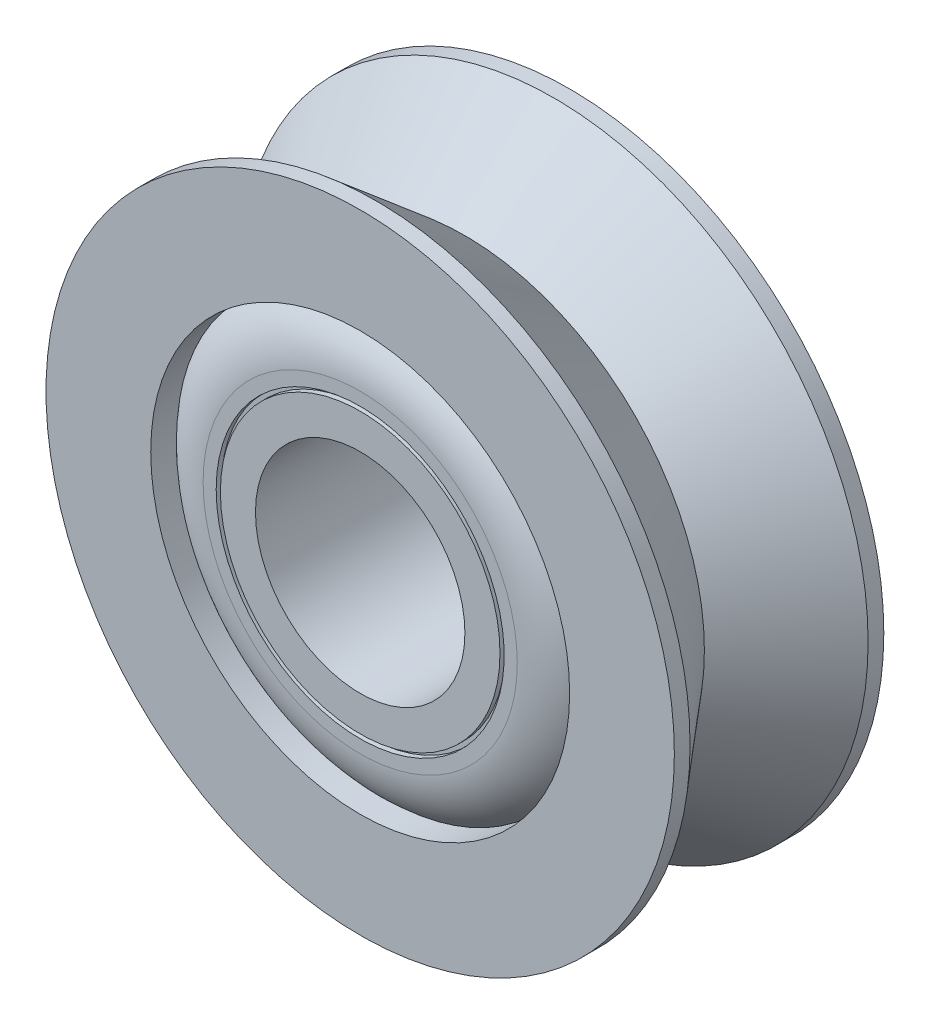
ISO-10303-21;
HEADER;
FILE_DESCRIPTION(('STEP AP214'),'2;1');
FILE_NAME('part.step','',(''),(''),'','','');
FILE_SCHEMA(('AUTOMOTIVE_DESIGN { 1 0 10303 214 1 1 1 1 }'));
ENDSEC;
DATA;
#1=APPLICATION_CONTEXT('core data for automotive mechanical design processes');
#2=APPLICATION_PROTOCOL_DEFINITION('international standard','automotive_design',2000,#1);
#3=PRODUCT_CONTEXT('',#1,'mechanical');
#4=PRODUCT('Part','Part','',(#3));
#5=PRODUCT_RELATED_PRODUCT_CATEGORY('part','',(#4));
#6=PRODUCT_DEFINITION_FORMATION('','',#4);
#7=PRODUCT_DEFINITION_CONTEXT('part definition',#1,'design');
#8=PRODUCT_DEFINITION('design','',#6,#7);
#9=PRODUCT_DEFINITION_SHAPE('','',#8);
#10=(LENGTH_UNIT() NAMED_UNIT(*) SI_UNIT(.MILLI.,.METRE.));
#11=(NAMED_UNIT(*) PLANE_ANGLE_UNIT() SI_UNIT($,.RADIAN.));
#12=(NAMED_UNIT(*) SI_UNIT($,.STERADIAN.) SOLID_ANGLE_UNIT());
#13=UNCERTAINTY_MEASURE_WITH_UNIT(LENGTH_MEASURE(1.E-05),#10,'distance_accuracy_value','');
#14=(GEOMETRIC_REPRESENTATION_CONTEXT(3) GLOBAL_UNCERTAINTY_ASSIGNED_CONTEXT((#13)) GLOBAL_UNIT_ASSIGNED_CONTEXT((#10,
#11,#12)) REPRESENTATION_CONTEXT('',''));
#15=CARTESIAN_POINT('',(0.,0.,0.));
#16=DIRECTION('',(0.,0.,1.));
#17=DIRECTION('',(1.,0.,0.));
#18=AXIS2_PLACEMENT_3D('',#15,#16,#17);
#19=CARTESIAN_POINT('',(0.,0.,4.));
#20=DIRECTION('',(0.,0.,1.));
#21=DIRECTION('',(1.,0.,0.));
#22=AXIS2_PLACEMENT_3D('',#19,#20,#21);
#23=PLANE('',#22);
#24=CARTESIAN_POINT('',(0.,0.,4.));
#25=DIRECTION('',(0.,0.,-1.));
#26=DIRECTION('',(-1.,0.,0.));
#27=AXIS2_PLACEMENT_3D('',#24,#25,#26);
#28=CIRCLE('',#27,2.67);
#29=CARTESIAN_POINT('',(-2.67,0.,4.));
#30=VERTEX_POINT('',#29);
#31=EDGE_CURVE('E89',#30,#30,#28,.T.);
#32=ORIENTED_EDGE('',*,*,#31,.F.);
#33=EDGE_LOOP('',(#32));
#34=FACE_BOUND('',#33,.T.);
#35=CARTESIAN_POINT('',(0.,0.,4.));
#36=DIRECTION('',(0.,0.,-1.));
#37=DIRECTION('',(-1.,0.,0.));
#38=AXIS2_PLACEMENT_3D('',#35,#36,#37);
#39=CIRCLE('',#38,2.);
#40=CARTESIAN_POINT('',(-2.,0.,4.));
#41=VERTEX_POINT('',#40);
#42=EDGE_CURVE('E43',#41,#41,#39,.T.);
#43=ORIENTED_EDGE('',*,*,#42,.T.);
#44=EDGE_LOOP('',(#43));
#45=FACE_BOUND('',#44,.T.);
#46=ADVANCED_FACE('F32',(#34,#45),#23,.T.);
#47=CARTESIAN_POINT('',(0.,0.,0.));
#48=DIRECTION('',(0.,0.,1.));
#49=DIRECTION('',(1.,0.,0.));
#50=AXIS2_PLACEMENT_3D('',#47,#48,#49);
#51=PLANE('',#50);
#52=CARTESIAN_POINT('',(0.,0.,0.));
#53=DIRECTION('',(0.,0.,-1.));
#54=DIRECTION('',(-1.,0.,0.));
#55=AXIS2_PLACEMENT_3D('',#52,#53,#54);
#56=CIRCLE('',#55,2.67);
#57=CARTESIAN_POINT('',(-2.67,0.,0.));
#58=VERTEX_POINT('',#57);
#59=EDGE_CURVE('E77',#58,#58,#56,.T.);
#60=ORIENTED_EDGE('',*,*,#59,.T.);
#61=EDGE_LOOP('',(#60));
#62=FACE_BOUND('',#61,.T.);
#63=CARTESIAN_POINT('',(0.,0.,0.));
#64=DIRECTION('',(0.,0.,-1.));
#65=DIRECTION('',(-1.,0.,0.));
#66=AXIS2_PLACEMENT_3D('',#63,#64,#65);
#67=CIRCLE('',#66,2.);
#68=CARTESIAN_POINT('',(-2.,0.,0.));
#69=VERTEX_POINT('',#68);
#70=EDGE_CURVE('E45',#69,#69,#67,.T.);
#71=ORIENTED_EDGE('',*,*,#70,.F.);
#72=EDGE_LOOP('',(#71));
#73=FACE_BOUND('',#72,.T.);
#74=ADVANCED_FACE('F117',(#62,#73),#51,.F.);
#75=CARTESIAN_POINT('',(0.,0.,4.));
#76=DIRECTION('',(0.,0.,-1.));
#77=DIRECTION('',(-1.,0.,0.));
#78=AXIS2_PLACEMENT_3D('',#75,#76,#77);
#79=CIRCLE('',#78,2.75);
#80=CARTESIAN_POINT('',(-2.75,0.,4.));
#81=VERTEX_POINT('',#80);
#82=EDGE_CURVE('E98',#81,#81,#79,.T.);
#83=ORIENTED_EDGE('',*,*,#82,.T.);
#84=EDGE_LOOP('',(#83));
#85=FACE_BOUND('',#84,.T.);
#86=CARTESIAN_POINT('',(0.,0.,4.));
#87=DIRECTION('',(0.,0.,-1.));
#88=DIRECTION('',(-1.,0.,0.));
#89=AXIS2_PLACEMENT_3D('',#86,#87,#88);
#90=CIRCLE('',#89,3.);
#91=CARTESIAN_POINT('',(-3.,0.,4.));
#92=VERTEX_POINT('',#91);
#93=EDGE_CURVE('E68',#92,#92,#90,.T.);
#94=ORIENTED_EDGE('',*,*,#93,.F.);
#95=EDGE_LOOP('',(#94));
#96=FACE_BOUND('',#95,.T.);
#97=ADVANCED_FACE('F102',(#85,#96),#23,.T.);
#98=CARTESIAN_POINT('',(0.,0.,0.));
#99=DIRECTION('',(0.,0.,-1.));
#100=DIRECTION('',(-1.,0.,0.));
#101=AXIS2_PLACEMENT_3D('',#98,#99,#100);
#102=CIRCLE('',#101,2.75);
#103=CARTESIAN_POINT('',(-2.75,0.,0.));
#104=VERTEX_POINT('',#103);
#105=EDGE_CURVE('E86',#104,#104,#102,.T.);
#106=ORIENTED_EDGE('',*,*,#105,.F.);
#107=EDGE_LOOP('',(#106));
#108=FACE_BOUND('',#107,.T.);
#109=CARTESIAN_POINT('',(0.,0.,0.));
#110=DIRECTION('',(0.,0.,-1.));
#111=DIRECTION('',(-1.,0.,0.));
#112=AXIS2_PLACEMENT_3D('',#109,#110,#111);
#113=CIRCLE('',#112,3.);
#114=CARTESIAN_POINT('',(-3.,0.,0.));
#115=VERTEX_POINT('',#114);
#116=EDGE_CURVE('E59',#115,#115,#113,.T.);
#117=ORIENTED_EDGE('',*,*,#116,.T.);
#118=EDGE_LOOP('',(#117));
#119=FACE_BOUND('',#118,.T.);
#120=ADVANCED_FACE('F125',(#108,#119),#51,.F.);
#121=CARTESIAN_POINT('',(0.,0.,4.));
#122=DIRECTION('',(0.,0.,-1.));
#123=DIRECTION('',(-1.,0.,0.));
#124=AXIS2_PLACEMENT_3D('',#121,#122,#123);
#125=CYLINDRICAL_SURFACE('',#124,6.);
#126=CARTESIAN_POINT('',(0.,0.,0.));
#127=DIRECTION('',(0.,0.,1.));
#128=DIRECTION('',(1.,0.,0.));
#129=AXIS2_PLACEMENT_3D('',#126,#127,#128);
#130=CIRCLE('',#129,6.);
#131=CARTESIAN_POINT('',(6.,0.,0.));
#132=VERTEX_POINT('',#131);
#133=EDGE_CURVE('E36',#132,#132,#130,.T.);
#134=ORIENTED_EDGE('',*,*,#133,.T.);
#135=EDGE_LOOP('',(#134));
#136=FACE_BOUND('',#135,.T.);
#137=CARTESIAN_POINT('',(0.,0.,0.3));
#138=DIRECTION('',(0.,0.,1.));
#139=DIRECTION('',(1.,0.,0.));
#140=AXIS2_PLACEMENT_3D('',#137,#138,#139);
#141=CIRCLE('',#140,6.);
#142=CARTESIAN_POINT('',(6.,0.,0.3));
#143=VERTEX_POINT('',#142);
#144=EDGE_CURVE('E48',#143,#143,#141,.T.);
#145=ORIENTED_EDGE('',*,*,#144,.F.);
#146=EDGE_LOOP('',(#145));
#147=FACE_BOUND('',#146,.T.);
#148=ADVANCED_FACE('F34',(#136,#147),#125,.T.);
#149=CARTESIAN_POINT('',(0.,0.,4.));
#150=DIRECTION('',(0.,0.,1.));
#151=DIRECTION('',(1.,0.,0.));
#152=AXIS2_PLACEMENT_3D('',#149,#150,#151);
#153=CIRCLE('',#152,6.);
#154=CARTESIAN_POINT('',(6.,0.,4.));
#155=VERTEX_POINT('',#154);
#156=EDGE_CURVE('E10',#155,#155,#153,.T.);
#157=ORIENTED_EDGE('',*,*,#156,.F.);
#158=EDGE_LOOP('',(#157));
#159=FACE_BOUND('',#158,.T.);
#160=CARTESIAN_POINT('',(0.,0.,3.7));
#161=DIRECTION('',(0.,0.,1.));
#162=DIRECTION('',(1.,0.,0.));
#163=AXIS2_PLACEMENT_3D('',#160,#161,#162);
#164=CIRCLE('',#163,6.);
#165=CARTESIAN_POINT('',(6.,0.,3.7));
#166=VERTEX_POINT('',#165);
#167=EDGE_CURVE('E53',#166,#166,#164,.T.);
#168=ORIENTED_EDGE('',*,*,#167,.T.);
#169=EDGE_LOOP('',(#168));
#170=FACE_BOUND('',#169,.T.);
#171=ADVANCED_FACE('F132',(#159,#170),#125,.T.);
#172=CARTESIAN_POINT('',(0.,0.,4.));
#173=DIRECTION('',(0.,0.,-1.));
#174=DIRECTION('',(-1.,0.,0.));
#175=AXIS2_PLACEMENT_3D('',#172,#173,#174);
#176=CIRCLE('',#175,4.);
#177=CARTESIAN_POINT('',(-4.,0.,4.));
#178=VERTEX_POINT('',#177);
#179=EDGE_CURVE('E74',#178,#178,#176,.T.);
#180=ORIENTED_EDGE('',*,*,#179,.T.);
#181=EDGE_LOOP('',(#180));
#182=FACE_BOUND('',#181,.T.);
#183=ORIENTED_EDGE('',*,*,#156,.T.);
#184=EDGE_LOOP('',(#183));
#185=FACE_BOUND('',#184,.T.);
#186=ADVANCED_FACE('F120',(#182,#185),#23,.T.);
#187=CARTESIAN_POINT('',(0.,0.,0.));
#188=DIRECTION('',(0.,0.,-1.));
#189=DIRECTION('',(-1.,0.,0.));
#190=AXIS2_PLACEMENT_3D('',#187,#188,#189);
#191=CIRCLE('',#190,4.);
#192=CARTESIAN_POINT('',(-4.,0.,0.));
#193=VERTEX_POINT('',#192);
#194=EDGE_CURVE('E65',#193,#193,#191,.T.);
#195=ORIENTED_EDGE('',*,*,#194,.F.);
#196=EDGE_LOOP('',(#195));
#197=FACE_BOUND('',#196,.T.);
#198=ORIENTED_EDGE('',*,*,#133,.F.);
#199=EDGE_LOOP('',(#198));
#200=FACE_BOUND('',#199,.T.);
#201=ADVANCED_FACE('F126',(#197,#200),#51,.F.);
#202=CARTESIAN_POINT('',(0.,0.,4.));
#203=DIRECTION('',(0.,0.,-1.));
#204=DIRECTION('',(-1.,0.,0.));
#205=AXIS2_PLACEMENT_3D('',#202,#203,#204);
#206=CYLINDRICAL_SURFACE('',#205,2.);
#207=ORIENTED_EDGE('',*,*,#42,.F.);
#208=EDGE_LOOP('',(#207));
#209=FACE_BOUND('',#208,.T.);
#210=ORIENTED_EDGE('',*,*,#70,.T.);
#211=EDGE_LOOP('',(#210));
#212=FACE_BOUND('',#211,.T.);
#213=ADVANCED_FACE('F138',(#209,#212),#206,.F.);
#214=CARTESIAN_POINT('',(0.,0.,2.));
#215=DIRECTION('',(0.,0.,-1.));
#216=DIRECTION('',(-1.,0.,0.));
#217=AXIS2_PLACEMENT_3D('',#214,#215,#216);
#218=CONICAL_SURFACE('',#217,4.57353062699861,0.698131700797737);
#219=ORIENTED_EDGE('',*,*,#144,.T.);
#220=EDGE_LOOP('',(#219));
#221=FACE_BOUND('',#220,.T.);
#222=CARTESIAN_POINT('',(0.,0.,2.));
#223=DIRECTION('',(0.,0.,1.));
#224=DIRECTION('',(1.,0.,0.));
#225=AXIS2_PLACEMENT_3D('',#222,#223,#224);
#226=CIRCLE('',#225,4.57353062699861);
#227=CARTESIAN_POINT('',(4.57353062699861,0.,2.));
#228=VERTEX_POINT('',#227);
#229=EDGE_CURVE('E56',#228,#228,#226,.T.);
#230=ORIENTED_EDGE('',*,*,#229,.F.);
#231=EDGE_LOOP('',(#230));
#232=FACE_BOUND('',#231,.T.);
#233=ADVANCED_FACE('F171',(#221,#232),#218,.T.);
#234=CARTESIAN_POINT('',(0.,0.,3.7));
#235=DIRECTION('',(0.,0.,1.));
#236=DIRECTION('',(1.,0.,0.));
#237=AXIS2_PLACEMENT_3D('',#234,#235,#236);
#238=CONICAL_SURFACE('',#237,6.,0.698131700797737);
#239=ORIENTED_EDGE('',*,*,#229,.T.);
#240=EDGE_LOOP('',(#239));
#241=FACE_BOUND('',#240,.T.);
#242=ORIENTED_EDGE('',*,*,#167,.F.);
#243=EDGE_LOOP('',(#242));
#244=FACE_BOUND('',#243,.T.);
#245=ADVANCED_FACE('F167',(#241,#244),#238,.T.);
#246=CARTESIAN_POINT('',(0.,0.,1.32225346025478));
#247=DIRECTION('',(0.,0.,-1.));
#248=DIRECTION('',(-1.,0.,0.));
#249=AXIS2_PLACEMENT_3D('',#246,#247,#248);
#250=TOROIDAL_SURFACE('',#249,2.96387326987261,1.32274689709915);
#251=ORIENTED_EDGE('',*,*,#116,.F.);
#252=EDGE_LOOP('',(#251));
#253=FACE_BOUND('',#252,.T.);
#254=CARTESIAN_POINT('',(0.,0.,0.5));
#255=DIRECTION('',(0.,0.,-1.));
#256=DIRECTION('',(-1.,0.,0.));
#257=AXIS2_PLACEMENT_3D('',#254,#255,#256);
#258=CIRCLE('',#257,4.);
#259=CARTESIAN_POINT('',(-4.,0.,0.5));
#260=VERTEX_POINT('',#259);
#261=EDGE_CURVE('E62',#260,#260,#258,.T.);
#262=ORIENTED_EDGE('',*,*,#261,.T.);
#263=EDGE_LOOP('',(#262));
#264=FACE_BOUND('',#263,.T.);
#265=ADVANCED_FACE('F163',(#253,#264),#250,.T.);
#266=CARTESIAN_POINT('',(0.,0.,0.));
#267=DIRECTION('',(0.,0.,-1.));
#268=DIRECTION('',(-1.,0.,0.));
#269=AXIS2_PLACEMENT_3D('',#266,#267,#268);
#270=CYLINDRICAL_SURFACE('',#269,4.);
#271=ORIENTED_EDGE('',*,*,#261,.F.);
#272=EDGE_LOOP('',(#271));
#273=FACE_BOUND('',#272,.T.);
#274=ORIENTED_EDGE('',*,*,#194,.T.);
#275=EDGE_LOOP('',(#274));
#276=FACE_BOUND('',#275,.T.);
#277=ADVANCED_FACE('F156',(#273,#276),#270,.F.);
#278=CARTESIAN_POINT('',(0.,0.,2.67774653974522));
#279=DIRECTION('',(0.,0.,1.));
#280=DIRECTION('',(-1.,0.,0.));
#281=AXIS2_PLACEMENT_3D('',#278,#279,#280);
#282=TOROIDAL_SURFACE('',#281,2.96387326987261,1.32274689709915);
#283=ORIENTED_EDGE('',*,*,#93,.T.);
#284=EDGE_LOOP('',(#283));
#285=FACE_BOUND('',#284,.T.);
#286=CARTESIAN_POINT('',(0.,0.,3.5));
#287=DIRECTION('',(0.,0.,-1.));
#288=DIRECTION('',(-1.,0.,0.));
#289=AXIS2_PLACEMENT_3D('',#286,#287,#288);
#290=CIRCLE('',#289,4.);
#291=CARTESIAN_POINT('',(-4.,0.,3.5));
#292=VERTEX_POINT('',#291);
#293=EDGE_CURVE('E71',#292,#292,#290,.T.);
#294=ORIENTED_EDGE('',*,*,#293,.F.);
#295=EDGE_LOOP('',(#294));
#296=FACE_BOUND('',#295,.T.);
#297=ADVANCED_FACE('F146',(#285,#296),#282,.T.);
#298=CARTESIAN_POINT('',(0.,0.,4.));
#299=DIRECTION('',(0.,0.,1.));
#300=DIRECTION('',(-1.,0.,0.));
#301=AXIS2_PLACEMENT_3D('',#298,#299,#300);
#302=CYLINDRICAL_SURFACE('',#301,4.);
#303=ORIENTED_EDGE('',*,*,#293,.T.);
#304=EDGE_LOOP('',(#303));
#305=FACE_BOUND('',#304,.T.);
#306=ORIENTED_EDGE('',*,*,#179,.F.);
#307=EDGE_LOOP('',(#306));
#308=FACE_BOUND('',#307,.T.);
#309=ADVANCED_FACE('F143',(#305,#308),#302,.F.);
#310=CARTESIAN_POINT('',(0.,0.,0.));
#311=DIRECTION('',(0.,0.,-1.));
#312=DIRECTION('',(-1.,0.,0.));
#313=AXIS2_PLACEMENT_3D('',#310,#311,#312);
#314=CYLINDRICAL_SURFACE('',#313,2.67);
#315=ORIENTED_EDGE('',*,*,#59,.F.);
#316=EDGE_LOOP('',(#315));
#317=FACE_BOUND('',#316,.T.);
#318=CARTESIAN_POINT('',(0.,0.,0.1));
#319=DIRECTION('',(0.,0.,-1.));
#320=DIRECTION('',(-1.,0.,0.));
#321=AXIS2_PLACEMENT_3D('',#318,#319,#320);
#322=CIRCLE('',#321,2.67);
#323=CARTESIAN_POINT('',(-2.67,0.,0.1));
#324=VERTEX_POINT('',#323);
#325=EDGE_CURVE('E80',#324,#324,#322,.T.);
#326=ORIENTED_EDGE('',*,*,#325,.T.);
#327=EDGE_LOOP('',(#326));
#328=FACE_BOUND('',#327,.T.);
#329=ADVANCED_FACE('F145',(#317,#328),#314,.T.);
#330=CARTESIAN_POINT('',(0.,2.75,0.1));
#331=DIRECTION('',(0.,0.,1.));
#332=DIRECTION('',(1.,0.,0.));
#333=AXIS2_PLACEMENT_3D('',#330,#331,#332);
#334=PLANE('',#333);
#335=ORIENTED_EDGE('',*,*,#325,.F.);
#336=EDGE_LOOP('',(#335));
#337=FACE_BOUND('',#336,.T.);
#338=CARTESIAN_POINT('',(0.,0.,0.1));
#339=DIRECTION('',(0.,0.,-1.));
#340=DIRECTION('',(-1.,0.,0.));
#341=AXIS2_PLACEMENT_3D('',#338,#339,#340);
#342=CIRCLE('',#341,2.75);
#343=CARTESIAN_POINT('',(-2.75,0.,0.1));
#344=VERTEX_POINT('',#343);
#345=EDGE_CURVE('E83',#344,#344,#342,.T.);
#346=ORIENTED_EDGE('',*,*,#345,.T.);
#347=EDGE_LOOP('',(#346));
#348=FACE_BOUND('',#347,.T.);
#349=ADVANCED_FACE('F153',(#337,#348),#334,.F.);
#350=CARTESIAN_POINT('',(0.,0.,0.));
#351=DIRECTION('',(0.,0.,-1.));
#352=DIRECTION('',(-1.,0.,0.));
#353=AXIS2_PLACEMENT_3D('',#350,#351,#352);
#354=CYLINDRICAL_SURFACE('',#353,2.75);
#355=ORIENTED_EDGE('',*,*,#345,.F.);
#356=EDGE_LOOP('',(#355));
#357=FACE_BOUND('',#356,.T.);
#358=ORIENTED_EDGE('',*,*,#105,.T.);
#359=EDGE_LOOP('',(#358));
#360=FACE_BOUND('',#359,.T.);
#361=ADVANCED_FACE('F244',(#357,#360),#354,.F.);
#362=CARTESIAN_POINT('',(0.,0.,4.));
#363=DIRECTION('',(0.,0.,1.));
#364=DIRECTION('',(-1.,0.,0.));
#365=AXIS2_PLACEMENT_3D('',#362,#363,#364);
#366=CYLINDRICAL_SURFACE('',#365,2.67);
#367=ORIENTED_EDGE('',*,*,#31,.T.);
#368=EDGE_LOOP('',(#367));
#369=FACE_BOUND('',#368,.T.);
#370=CARTESIAN_POINT('',(0.,0.,3.9));
#371=DIRECTION('',(0.,0.,-1.));
#372=DIRECTION('',(-1.,0.,0.));
#373=AXIS2_PLACEMENT_3D('',#370,#371,#372);
#374=CIRCLE('',#373,2.67);
#375=CARTESIAN_POINT('',(-2.67,0.,3.9));
#376=VERTEX_POINT('',#375);
#377=EDGE_CURVE('E92',#376,#376,#374,.T.);
#378=ORIENTED_EDGE('',*,*,#377,.F.);
#379=EDGE_LOOP('',(#378));
#380=FACE_BOUND('',#379,.T.);
#381=ADVANCED_FACE('F113',(#369,#380),#366,.T.);
#382=CARTESIAN_POINT('',(0.,2.75,3.9));
#383=DIRECTION('',(0.,0.,-1.));
#384=DIRECTION('',(1.,0.,0.));
#385=AXIS2_PLACEMENT_3D('',#382,#383,#384);
#386=PLANE('',#385);
#387=ORIENTED_EDGE('',*,*,#377,.T.);
#388=EDGE_LOOP('',(#387));
#389=FACE_BOUND('',#388,.T.);
#390=CARTESIAN_POINT('',(0.,0.,3.9));
#391=DIRECTION('',(0.,0.,-1.));
#392=DIRECTION('',(-1.,0.,0.));
#393=AXIS2_PLACEMENT_3D('',#390,#391,#392);
#394=CIRCLE('',#393,2.75);
#395=CARTESIAN_POINT('',(-2.75,0.,3.9));
#396=VERTEX_POINT('',#395);
#397=EDGE_CURVE('E95',#396,#396,#394,.T.);
#398=ORIENTED_EDGE('',*,*,#397,.F.);
#399=EDGE_LOOP('',(#398));
#400=FACE_BOUND('',#399,.T.);
#401=ADVANCED_FACE('F107',(#389,#400),#386,.F.);
#402=CARTESIAN_POINT('',(0.,0.,4.));
#403=DIRECTION('',(0.,0.,1.));
#404=DIRECTION('',(-1.,0.,0.));
#405=AXIS2_PLACEMENT_3D('',#402,#403,#404);
#406=CYLINDRICAL_SURFACE('',#405,2.75);
#407=ORIENTED_EDGE('',*,*,#397,.T.);
#408=EDGE_LOOP('',(#407));
#409=FACE_BOUND('',#408,.T.);
#410=ORIENTED_EDGE('',*,*,#82,.F.);
#411=EDGE_LOOP('',(#410));
#412=FACE_BOUND('',#411,.T.);
#413=ADVANCED_FACE('F105',(#409,#412),#406,.F.);
#414=CLOSED_SHELL('',(#46,#74,#97,#120,#148,#171,#186,#201,#213,#233,#245,#265,#277,#297,#309,
#329,#349,#361,#381,#401,#413));
#415=MANIFOLD_SOLID_BREP('B2',#414);
#416=ADVANCED_BREP_SHAPE_REPRESENTATION('',(#18,#415),#14);
#417=SHAPE_DEFINITION_REPRESENTATION(#9,#416);
ENDSEC;
END-ISO-10303-21;
